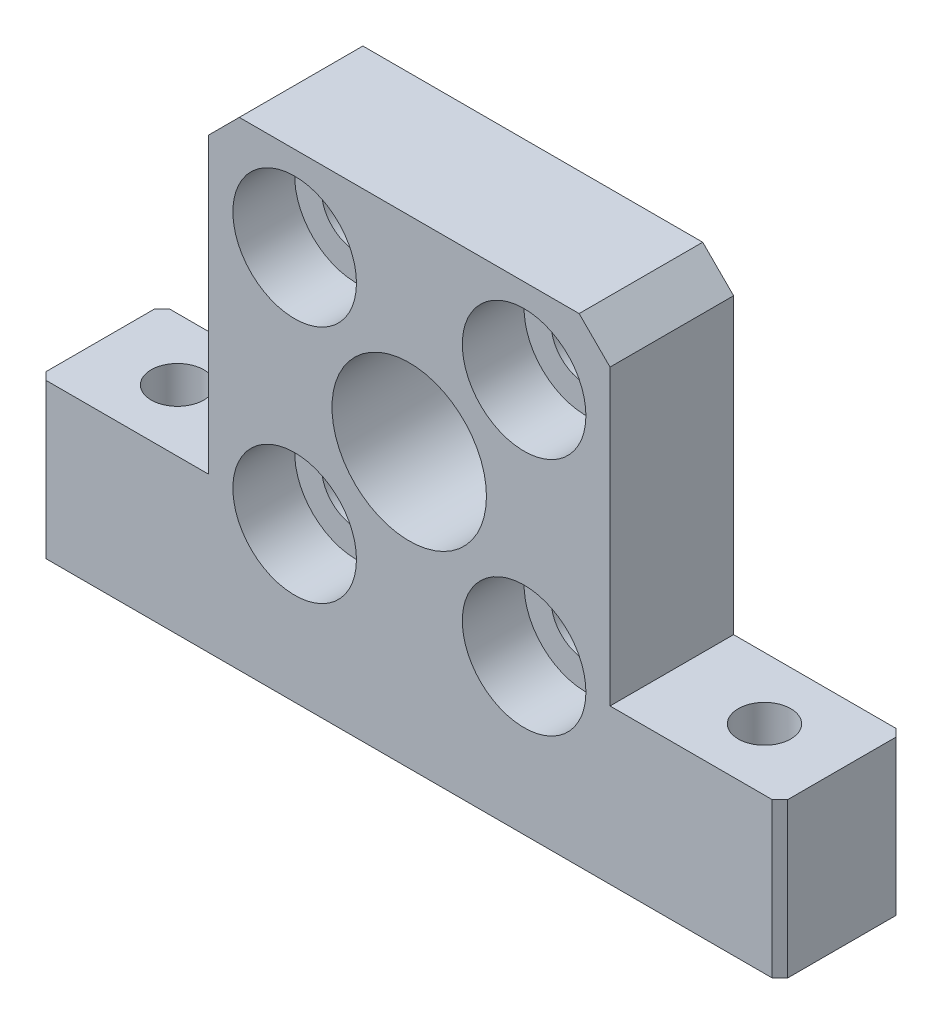
ISO-10303-21;
HEADER;
FILE_DESCRIPTION(('STEP AP214'),'2;1');
FILE_NAME('part.step','',(''),(''),'','','');
FILE_SCHEMA(('AUTOMOTIVE_DESIGN { 1 0 10303 214 1 1 1 1 }'));
ENDSEC;
DATA;
#1=APPLICATION_CONTEXT('core data for automotive mechanical design processes');
#2=APPLICATION_PROTOCOL_DEFINITION('international standard','automotive_design',2000,#1);
#3=PRODUCT_CONTEXT('',#1,'mechanical');
#4=PRODUCT('Part','Part','',(#3));
#5=PRODUCT_RELATED_PRODUCT_CATEGORY('part','',(#4));
#6=PRODUCT_DEFINITION_FORMATION('','',#4);
#7=PRODUCT_DEFINITION_CONTEXT('part definition',#1,'design');
#8=PRODUCT_DEFINITION('design','',#6,#7);
#9=PRODUCT_DEFINITION_SHAPE('','',#8);
#10=(LENGTH_UNIT() NAMED_UNIT(*) SI_UNIT(.MILLI.,.METRE.));
#11=(NAMED_UNIT(*) PLANE_ANGLE_UNIT() SI_UNIT($,.RADIAN.));
#12=(NAMED_UNIT(*) SI_UNIT($,.STERADIAN.) SOLID_ANGLE_UNIT());
#13=UNCERTAINTY_MEASURE_WITH_UNIT(LENGTH_MEASURE(1.E-05),#10,'distance_accuracy_value','');
#14=(GEOMETRIC_REPRESENTATION_CONTEXT(3) GLOBAL_UNCERTAINTY_ASSIGNED_CONTEXT((#13)) GLOBAL_UNIT_ASSIGNED_CONTEXT((#10,
#11,#12)) REPRESENTATION_CONTEXT('',''));
#15=CARTESIAN_POINT('',(0.,0.,0.));
#16=DIRECTION('',(0.,0.,1.));
#17=DIRECTION('',(1.,0.,0.));
#18=AXIS2_PLACEMENT_3D('',#15,#16,#17);
#19=CARTESIAN_POINT('',(-3.43711475409836,-11.0194754098361,8.));
#20=DIRECTION('',(0.,0.,-1.));
#21=DIRECTION('',(-1.,0.,0.));
#22=AXIS2_PLACEMENT_3D('',#19,#20,#21);
#23=CYLINDRICAL_SURFACE('',#22,2.25);
#24=CARTESIAN_POINT('',(-3.43711475409836,-11.0194754098361,0.));
#25=DIRECTION('',(0.,0.,1.));
#26=DIRECTION('',(1.,0.,0.));
#27=AXIS2_PLACEMENT_3D('',#24,#25,#26);
#28=CIRCLE('',#27,2.25);
#29=CARTESIAN_POINT('',(-1.18711475409836,-11.0194754098361,0.));
#30=VERTEX_POINT('',#29);
#31=EDGE_CURVE('E265',#30,#30,#28,.T.);
#32=ORIENTED_EDGE('',*,*,#31,.F.);
#33=EDGE_LOOP('',(#32));
#34=FACE_BOUND('',#33,.T.);
#35=CARTESIAN_POINT('',(-3.43711475409836,-11.0194754098361,4.));
#36=DIRECTION('',(0.,0.,1.));
#37=DIRECTION('',(1.,0.,0.));
#38=AXIS2_PLACEMENT_3D('',#35,#36,#37);
#39=CIRCLE('',#38,2.25);
#40=CARTESIAN_POINT('',(-1.18711475409836,-11.0194754098361,4.));
#41=VERTEX_POINT('',#40);
#42=EDGE_CURVE('E181',#41,#41,#39,.T.);
#43=ORIENTED_EDGE('',*,*,#42,.T.);
#44=EDGE_LOOP('',(#43));
#45=FACE_BOUND('',#44,.T.);
#46=ADVANCED_FACE('F32',(#34,#45),#23,.F.);
#47=CARTESIAN_POINT('',(11.416131147541,-11.0194754098361,8.));
#48=DIRECTION('',(0.,0.,-1.));
#49=DIRECTION('',(-1.,0.,0.));
#50=AXIS2_PLACEMENT_3D('',#47,#48,#49);
#51=CYLINDRICAL_SURFACE('',#50,2.25);
#52=CARTESIAN_POINT('',(11.416131147541,-11.0194754098361,0.));
#53=DIRECTION('',(0.,0.,1.));
#54=DIRECTION('',(1.,0.,0.));
#55=AXIS2_PLACEMENT_3D('',#52,#53,#54);
#56=CIRCLE('',#55,2.25);
#57=CARTESIAN_POINT('',(13.666131147541,-11.0194754098361,0.));
#58=VERTEX_POINT('',#57);
#59=EDGE_CURVE('E275',#58,#58,#56,.T.);
#60=ORIENTED_EDGE('',*,*,#59,.F.);
#61=EDGE_LOOP('',(#60));
#62=FACE_BOUND('',#61,.T.);
#63=CARTESIAN_POINT('',(11.416131147541,-11.0194754098361,4.));
#64=DIRECTION('',(0.,0.,1.));
#65=DIRECTION('',(1.,0.,0.));
#66=AXIS2_PLACEMENT_3D('',#63,#64,#65);
#67=CIRCLE('',#66,2.25);
#68=CARTESIAN_POINT('',(13.666131147541,-11.0194754098361,4.));
#69=VERTEX_POINT('',#68);
#70=EDGE_CURVE('E177',#69,#69,#67,.T.);
#71=ORIENTED_EDGE('',*,*,#70,.T.);
#72=EDGE_LOOP('',(#71));
#73=FACE_BOUND('',#72,.T.);
#74=ADVANCED_FACE('F376',(#62,#73),#51,.F.);
#75=CARTESIAN_POINT('',(11.416131147541,4.48052459016393,8.));
#76=DIRECTION('',(0.,0.,-1.));
#77=DIRECTION('',(-1.,0.,0.));
#78=AXIS2_PLACEMENT_3D('',#75,#76,#77);
#79=CYLINDRICAL_SURFACE('',#78,2.25);
#80=CARTESIAN_POINT('',(11.416131147541,4.48052459016393,0.));
#81=DIRECTION('',(0.,0.,1.));
#82=DIRECTION('',(1.,0.,0.));
#83=AXIS2_PLACEMENT_3D('',#80,#81,#82);
#84=CIRCLE('',#83,2.25);
#85=CARTESIAN_POINT('',(13.666131147541,4.48052459016393,0.));
#86=VERTEX_POINT('',#85);
#87=EDGE_CURVE('E281',#86,#86,#84,.T.);
#88=ORIENTED_EDGE('',*,*,#87,.F.);
#89=EDGE_LOOP('',(#88));
#90=FACE_BOUND('',#89,.T.);
#91=CARTESIAN_POINT('',(11.416131147541,4.48052459016393,4.));
#92=DIRECTION('',(0.,0.,1.));
#93=DIRECTION('',(1.,0.,0.));
#94=AXIS2_PLACEMENT_3D('',#91,#92,#93);
#95=CIRCLE('',#94,2.25);
#96=CARTESIAN_POINT('',(13.666131147541,4.48052459016393,4.));
#97=VERTEX_POINT('',#96);
#98=EDGE_CURVE('E174',#97,#97,#95,.T.);
#99=ORIENTED_EDGE('',*,*,#98,.T.);
#100=EDGE_LOOP('',(#99));
#101=FACE_BOUND('',#100,.T.);
#102=ADVANCED_FACE('F382',(#90,#101),#79,.F.);
#103=CARTESIAN_POINT('',(-3.43711475409836,4.48052459016393,8.));
#104=DIRECTION('',(0.,0.,-1.));
#105=DIRECTION('',(-1.,0.,0.));
#106=AXIS2_PLACEMENT_3D('',#103,#104,#105);
#107=CYLINDRICAL_SURFACE('',#106,2.25);
#108=CARTESIAN_POINT('',(-3.43711475409836,4.48052459016393,0.));
#109=DIRECTION('',(0.,0.,1.));
#110=DIRECTION('',(1.,0.,0.));
#111=AXIS2_PLACEMENT_3D('',#108,#109,#110);
#112=CIRCLE('',#111,2.25);
#113=CARTESIAN_POINT('',(-1.18711475409836,4.48052459016393,0.));
#114=VERTEX_POINT('',#113);
#115=EDGE_CURVE('E278',#114,#114,#112,.T.);
#116=ORIENTED_EDGE('',*,*,#115,.F.);
#117=EDGE_LOOP('',(#116));
#118=FACE_BOUND('',#117,.T.);
#119=CARTESIAN_POINT('',(-3.43711475409836,4.48052459016393,4.));
#120=DIRECTION('',(0.,0.,1.));
#121=DIRECTION('',(1.,0.,0.));
#122=AXIS2_PLACEMENT_3D('',#119,#120,#121);
#123=CIRCLE('',#122,2.25);
#124=CARTESIAN_POINT('',(-1.18711475409836,4.48052459016393,4.));
#125=VERTEX_POINT('',#124);
#126=EDGE_CURVE('E169',#125,#125,#123,.T.);
#127=ORIENTED_EDGE('',*,*,#126,.T.);
#128=EDGE_LOOP('',(#127));
#129=FACE_BOUND('',#128,.T.);
#130=ADVANCED_FACE('F391',(#118,#129),#107,.F.);
#131=CARTESIAN_POINT('',(0.,0.,8.));
#132=DIRECTION('',(0.,0.,1.));
#133=DIRECTION('',(1.,0.,0.));
#134=AXIS2_PLACEMENT_3D('',#131,#132,#133);
#135=PLANE('',#134);
#136=CARTESIAN_POINT('',(11.416131147541,4.48052459016393,8.));
#137=DIRECTION('',(0.,0.,1.));
#138=DIRECTION('',(1.,0.,0.));
#139=AXIS2_PLACEMENT_3D('',#136,#137,#138);
#140=CIRCLE('',#139,4.);
#141=CARTESIAN_POINT('',(15.416131147541,4.48052459016393,8.));
#142=VERTEX_POINT('',#141);
#143=EDGE_CURVE('E306',#142,#142,#140,.T.);
#144=ORIENTED_EDGE('',*,*,#143,.F.);
#145=EDGE_LOOP('',(#144));
#146=FACE_BOUND('',#145,.T.);
#147=CARTESIAN_POINT('',(-3.43711475409836,-11.0194754098361,8.));
#148=DIRECTION('',(0.,0.,1.));
#149=DIRECTION('',(1.,0.,0.));
#150=AXIS2_PLACEMENT_3D('',#147,#148,#149);
#151=CIRCLE('',#150,4.);
#152=CARTESIAN_POINT('',(0.562885245901642,-11.0194754098361,8.));
#153=VERTEX_POINT('',#152);
#154=EDGE_CURVE('E300',#153,#153,#151,.T.);
#155=ORIENTED_EDGE('',*,*,#154,.F.);
#156=EDGE_LOOP('',(#155));
#157=FACE_BOUND('',#156,.T.);
#158=CARTESIAN_POINT('',(11.416131147541,-11.0194754098361,8.));
#159=DIRECTION('',(0.,0.,1.));
#160=DIRECTION('',(1.,0.,0.));
#161=AXIS2_PLACEMENT_3D('',#158,#159,#160);
#162=CIRCLE('',#161,4.);
#163=CARTESIAN_POINT('',(15.416131147541,-11.0194754098361,8.));
#164=VERTEX_POINT('',#163);
#165=EDGE_CURVE('E293',#164,#164,#162,.T.);
#166=ORIENTED_EDGE('',*,*,#165,.F.);
#167=EDGE_LOOP('',(#166));
#168=FACE_BOUND('',#167,.T.);
#169=CARTESIAN_POINT('',(-3.43711475409836,4.48052459016393,8.));
#170=DIRECTION('',(0.,0.,1.));
#171=DIRECTION('',(1.,0.,0.));
#172=AXIS2_PLACEMENT_3D('',#169,#170,#171);
#173=CIRCLE('',#172,4.);
#174=CARTESIAN_POINT('',(0.562885245901642,4.48052459016393,8.));
#175=VERTEX_POINT('',#174);
#176=EDGE_CURVE('E184',#175,#175,#173,.T.);
#177=ORIENTED_EDGE('',*,*,#176,.F.);
#178=EDGE_LOOP('',(#177));
#179=FACE_BOUND('',#178,.T.);
#180=DIRECTION('',(1.,0.,0.));
#181=VECTOR('',#180,1.);
#182=CARTESIAN_POINT('',(-20.0218579234973,-21.0194754098361,8.));
#183=LINE('',#182,#181);
#184=CARTESIAN_POINT('',(-19.5218579234973,-21.0194754098361,8.));
#185=VERTEX_POINT('',#184);
#186=CARTESIAN_POINT('',(27.4781420765028,-21.0194754098361,8.));
#187=VERTEX_POINT('',#186);
#188=EDGE_CURVE('E154',#185,#187,#183,.T.);
#189=ORIENTED_EDGE('',*,*,#188,.T.);
#190=DIRECTION('',(0.,1.,0.));
#191=VECTOR('',#190,1.);
#192=CARTESIAN_POINT('',(27.4781420765027,-11.0194754098361,8.));
#193=LINE('',#192,#191);
#194=CARTESIAN_POINT('',(27.4781420765027,-11.0194754098361,8.));
#195=VERTEX_POINT('',#194);
#196=EDGE_CURVE('E205',#187,#195,#193,.T.);
#197=ORIENTED_EDGE('',*,*,#196,.T.);
#198=DIRECTION('',(-1.,0.,0.));
#199=VECTOR('',#198,1.);
#200=CARTESIAN_POINT('',(16.9781420765027,-11.0194754098361,8.));
#201=LINE('',#200,#199);
#202=CARTESIAN_POINT('',(16.9781420765027,-11.0194754098361,8.));
#203=VERTEX_POINT('',#202);
#204=EDGE_CURVE('E270',#195,#203,#201,.T.);
#205=ORIENTED_EDGE('',*,*,#204,.T.);
#206=DIRECTION('',(0.,1.,0.));
#207=VECTOR('',#206,1.);
#208=CARTESIAN_POINT('',(16.9781420765027,9.98052459016393,8.));
#209=LINE('',#208,#207);
#210=CARTESIAN_POINT('',(16.9781420765027,7.98052459016392,8.));
#211=VERTEX_POINT('',#210);
#212=EDGE_CURVE('E267',#203,#211,#209,.T.);
#213=ORIENTED_EDGE('',*,*,#212,.T.);
#214=DIRECTION('',(0.707106781186546,-0.707106781186549,0.));
#215=VECTOR('',#214,1.);
#216=CARTESIAN_POINT('',(12.4793333333334,12.4793333333333,8.));
#217=LINE('',#216,#215);
#218=CARTESIAN_POINT('',(14.9781420765027,9.98052459016393,8.));
#219=VERTEX_POINT('',#218);
#220=EDGE_CURVE('E199',#211,#219,#217,.F.);
#221=ORIENTED_EDGE('',*,*,#220,.T.);
#222=DIRECTION('',(-1.,0.,0.));
#223=VECTOR('',#222,1.);
#224=CARTESIAN_POINT('',(-9.02185792349727,9.98052459016393,8.));
#225=LINE('',#224,#223);
#226=CARTESIAN_POINT('',(-7.02185792349725,9.98052459016393,8.));
#227=VERTEX_POINT('',#226);
#228=EDGE_CURVE('E252',#219,#227,#225,.T.);
#229=ORIENTED_EDGE('',*,*,#228,.T.);
#230=DIRECTION('',(0.707106781186549,0.707106781186546,0.));
#231=VECTOR('',#230,1.);
#232=CARTESIAN_POINT('',(-8.50119125683058,8.50119125683061,8.));
#233=LINE('',#232,#231);
#234=CARTESIAN_POINT('',(-9.02185792349727,7.98052459016392,8.));
#235=VERTEX_POINT('',#234);
#236=EDGE_CURVE('E143',#227,#235,#233,.F.);
#237=ORIENTED_EDGE('',*,*,#236,.T.);
#238=DIRECTION('',(0.,-1.,0.));
#239=VECTOR('',#238,1.);
#240=CARTESIAN_POINT('',(-9.02185792349727,9.98052459016393,8.));
#241=LINE('',#240,#239);
#242=CARTESIAN_POINT('',(-9.02185792349726,-11.0194754098361,8.));
#243=VERTEX_POINT('',#242);
#244=EDGE_CURVE('E133',#235,#243,#241,.T.);
#245=ORIENTED_EDGE('',*,*,#244,.T.);
#246=DIRECTION('',(-1.,0.,0.));
#247=VECTOR('',#246,1.);
#248=CARTESIAN_POINT('',(-20.0218579234973,-11.0194754098361,8.));
#249=LINE('',#248,#247);
#250=CARTESIAN_POINT('',(-19.5218579234973,-11.0194754098361,8.));
#251=VERTEX_POINT('',#250);
#252=EDGE_CURVE('E139',#243,#251,#249,.T.);
#253=ORIENTED_EDGE('',*,*,#252,.T.);
#254=DIRECTION('',(0.,-1.,0.));
#255=VECTOR('',#254,1.);
#256=CARTESIAN_POINT('',(-19.5218579234973,-21.0194754098361,8.));
#257=LINE('',#256,#255);
#258=EDGE_CURVE('E203',#251,#185,#257,.T.);
#259=ORIENTED_EDGE('',*,*,#258,.T.);
#260=EDGE_LOOP('',(#189,#197,#205,#213,#221,#229,#237,#245,#253,#259));
#261=FACE_BOUND('',#260,.T.);
#262=CARTESIAN_POINT('',(3.97814207650273,-3.26947540983607,8.));
#263=DIRECTION('',(0.,0.,1.));
#264=DIRECTION('',(1.,0.,0.));
#265=AXIS2_PLACEMENT_3D('',#262,#263,#264);
#266=CIRCLE('',#265,5.);
#267=CARTESIAN_POINT('',(8.97814207650273,-3.26947540983607,8.));
#268=VERTEX_POINT('',#267);
#269=EDGE_CURVE('E284',#268,#268,#266,.T.);
#270=ORIENTED_EDGE('',*,*,#269,.F.);
#271=EDGE_LOOP('',(#270));
#272=FACE_BOUND('',#271,.T.);
#273=ADVANCED_FACE('F136',(#146,#157,#168,#179,#261,#272),#135,.T.);
#274=CARTESIAN_POINT('',(0.,0.,0.));
#275=DIRECTION('',(0.,0.,1.));
#276=DIRECTION('',(1.,0.,0.));
#277=AXIS2_PLACEMENT_3D('',#274,#275,#276);
#278=PLANE('',#277);
#279=DIRECTION('',(-1.,0.,0.));
#280=VECTOR('',#279,1.);
#281=CARTESIAN_POINT('',(16.9781420765027,-11.0194754098361,0.));
#282=LINE('',#281,#280);
#283=CARTESIAN_POINT('',(27.4781420765027,-11.0194754098361,0.));
#284=VERTEX_POINT('',#283);
#285=CARTESIAN_POINT('',(16.9781420765027,-11.0194754098361,0.));
#286=VERTEX_POINT('',#285);
#287=EDGE_CURVE('E258',#284,#286,#282,.T.);
#288=ORIENTED_EDGE('',*,*,#287,.F.);
#289=DIRECTION('',(0.,-1.,0.));
#290=VECTOR('',#289,1.);
#291=CARTESIAN_POINT('',(27.4781420765027,0.,0.));
#292=LINE('',#291,#290);
#293=CARTESIAN_POINT('',(27.4781420765027,-21.0194754098361,0.));
#294=VERTEX_POINT('',#293);
#295=EDGE_CURVE('E227',#284,#294,#292,.T.);
#296=ORIENTED_EDGE('',*,*,#295,.T.);
#297=DIRECTION('',(1.,0.,0.));
#298=VECTOR('',#297,1.);
#299=CARTESIAN_POINT('',(-20.0218579234973,-21.0194754098361,0.));
#300=LINE('',#299,#298);
#301=CARTESIAN_POINT('',(-19.5218579234973,-21.0194754098361,0.));
#302=VERTEX_POINT('',#301);
#303=EDGE_CURVE('E260',#302,#294,#300,.T.);
#304=ORIENTED_EDGE('',*,*,#303,.F.);
#305=DIRECTION('',(0.,1.,0.));
#306=VECTOR('',#305,1.);
#307=CARTESIAN_POINT('',(-19.5218579234973,0.,0.));
#308=LINE('',#307,#306);
#309=CARTESIAN_POINT('',(-19.5218579234973,-11.0194754098361,0.));
#310=VERTEX_POINT('',#309);
#311=EDGE_CURVE('E225',#302,#310,#308,.T.);
#312=ORIENTED_EDGE('',*,*,#311,.T.);
#313=DIRECTION('',(-1.,0.,0.));
#314=VECTOR('',#313,1.);
#315=CARTESIAN_POINT('',(-20.0218579234973,-11.0194754098361,0.));
#316=LINE('',#315,#314);
#317=CARTESIAN_POINT('',(-9.02185792349726,-11.0194754098361,0.));
#318=VERTEX_POINT('',#317);
#319=EDGE_CURVE('E262',#318,#310,#316,.T.);
#320=ORIENTED_EDGE('',*,*,#319,.F.);
#321=DIRECTION('',(0.,-1.,0.));
#322=VECTOR('',#321,1.);
#323=CARTESIAN_POINT('',(-9.02185792349727,9.98052459016393,0.));
#324=LINE('',#323,#322);
#325=CARTESIAN_POINT('',(-9.02185792349727,7.98052459016392,0.));
#326=VERTEX_POINT('',#325);
#327=EDGE_CURVE('E158',#326,#318,#324,.T.);
#328=ORIENTED_EDGE('',*,*,#327,.F.);
#329=DIRECTION('',(-0.707106781186549,-0.707106781186546,0.));
#330=VECTOR('',#329,1.);
#331=CARTESIAN_POINT('',(-9.02185792349727,7.98052459016392,0.));
#332=LINE('',#331,#330);
#333=CARTESIAN_POINT('',(-7.02185792349725,9.98052459016393,0.));
#334=VERTEX_POINT('',#333);
#335=EDGE_CURVE('E192',#326,#334,#332,.F.);
#336=ORIENTED_EDGE('',*,*,#335,.T.);
#337=DIRECTION('',(-1.,0.,0.));
#338=VECTOR('',#337,1.);
#339=CARTESIAN_POINT('',(-9.02185792349727,9.98052459016393,0.));
#340=LINE('',#339,#338);
#341=CARTESIAN_POINT('',(14.9781420765027,9.98052459016393,0.));
#342=VERTEX_POINT('',#341);
#343=EDGE_CURVE('E148',#342,#334,#340,.T.);
#344=ORIENTED_EDGE('',*,*,#343,.F.);
#345=DIRECTION('',(-0.707106781186546,0.707106781186549,0.));
#346=VECTOR('',#345,1.);
#347=CARTESIAN_POINT('',(14.9781420765027,9.98052459016393,0.));
#348=LINE('',#347,#346);
#349=CARTESIAN_POINT('',(16.9781420765027,7.98052459016392,0.));
#350=VERTEX_POINT('',#349);
#351=EDGE_CURVE('E194',#342,#350,#348,.F.);
#352=ORIENTED_EDGE('',*,*,#351,.T.);
#353=DIRECTION('',(0.,1.,0.));
#354=VECTOR('',#353,1.);
#355=CARTESIAN_POINT('',(16.9781420765027,9.98052459016393,0.));
#356=LINE('',#355,#354);
#357=EDGE_CURVE('E255',#286,#350,#356,.T.);
#358=ORIENTED_EDGE('',*,*,#357,.F.);
#359=EDGE_LOOP('',(#288,#296,#304,#312,#320,#328,#336,#344,#352,#358));
#360=FACE_BOUND('',#359,.T.);
#361=ORIENTED_EDGE('',*,*,#31,.T.);
#362=EDGE_LOOP('',(#361));
#363=FACE_BOUND('',#362,.T.);
#364=ORIENTED_EDGE('',*,*,#59,.T.);
#365=EDGE_LOOP('',(#364));
#366=FACE_BOUND('',#365,.T.);
#367=ORIENTED_EDGE('',*,*,#115,.T.);
#368=EDGE_LOOP('',(#367));
#369=FACE_BOUND('',#368,.T.);
#370=ORIENTED_EDGE('',*,*,#87,.T.);
#371=EDGE_LOOP('',(#370));
#372=FACE_BOUND('',#371,.T.);
#373=CARTESIAN_POINT('',(3.97814207650273,-3.26947540983607,0.));
#374=DIRECTION('',(0.,0.,1.));
#375=DIRECTION('',(1.,0.,0.));
#376=AXIS2_PLACEMENT_3D('',#373,#374,#375);
#377=CIRCLE('',#376,5.);
#378=CARTESIAN_POINT('',(8.97814207650273,-3.26947540983607,0.));
#379=VERTEX_POINT('',#378);
#380=EDGE_CURVE('E172',#379,#379,#377,.T.);
#381=ORIENTED_EDGE('',*,*,#380,.T.);
#382=EDGE_LOOP('',(#381));
#383=FACE_BOUND('',#382,.T.);
#384=ADVANCED_FACE('F353',(#360,#363,#366,#369,#372,#383),#278,.F.);
#385=CARTESIAN_POINT('',(-9.02185792349727,9.98052459016393,8.));
#386=DIRECTION('',(1.,0.,0.));
#387=DIRECTION('',(0.,1.,0.));
#388=AXIS2_PLACEMENT_3D('',#385,#386,#387);
#389=PLANE('',#388);
#390=ORIENTED_EDGE('',*,*,#244,.F.);
#391=DIRECTION('',(0.,0.,-1.));
#392=VECTOR('',#391,1.);
#393=CARTESIAN_POINT('',(-9.02185792349727,7.98052459016392,8.));
#394=LINE('',#393,#392);
#395=EDGE_CURVE('E201',#235,#326,#394,.T.);
#396=ORIENTED_EDGE('',*,*,#395,.T.);
#397=ORIENTED_EDGE('',*,*,#327,.T.);
#398=DIRECTION('',(0.,0.,-1.));
#399=VECTOR('',#398,1.);
#400=CARTESIAN_POINT('',(-9.02185792349726,-11.0194754098361,8.));
#401=LINE('',#400,#399);
#402=EDGE_CURVE('E152',#243,#318,#401,.T.);
#403=ORIENTED_EDGE('',*,*,#402,.F.);
#404=EDGE_LOOP('',(#390,#396,#397,#403));
#405=FACE_BOUND('',#404,.T.);
#406=ADVANCED_FACE('F156',(#405),#389,.F.);
#407=CARTESIAN_POINT('',(-20.0218579234973,-11.0194754098361,8.));
#408=DIRECTION('',(0.,-1.,0.));
#409=DIRECTION('',(0.,0.,-1.));
#410=AXIS2_PLACEMENT_3D('',#407,#408,#409);
#411=PLANE('',#410);
#412=CARTESIAN_POINT('',(-15.0218579234973,-11.0194754098361,4.));
#413=DIRECTION('',(0.,-1.,0.));
#414=DIRECTION('',(0.,0.,-1.));
#415=AXIS2_PLACEMENT_3D('',#412,#413,#414);
#416=CIRCLE('',#415,1.70157274707284);
#417=CARTESIAN_POINT('',(-15.0218579234973,-11.0194754098361,2.29842725292716));
#418=VERTEX_POINT('',#417);
#419=EDGE_CURVE('E297',#418,#418,#416,.T.);
#420=ORIENTED_EDGE('',*,*,#419,.T.);
#421=EDGE_LOOP('',(#420));
#422=FACE_BOUND('',#421,.T.);
#423=ORIENTED_EDGE('',*,*,#319,.T.);
#424=DIRECTION('',(0.707106781186552,0.,-0.707106781186543));
#425=VECTOR('',#424,1.);
#426=CARTESIAN_POINT('',(-20.0218579234973,-11.0194754098361,0.499999999999994));
#427=LINE('',#426,#425);
#428=CARTESIAN_POINT('',(-20.0218579234973,-11.0194754098361,0.499999999999994));
#429=VERTEX_POINT('',#428);
#430=EDGE_CURVE('E11',#310,#429,#427,.F.);
#431=ORIENTED_EDGE('',*,*,#430,.T.);
#432=DIRECTION('',(0.,0.,-1.));
#433=VECTOR('',#432,1.);
#434=CARTESIAN_POINT('',(-20.0218579234973,-11.0194754098361,8.));
#435=LINE('',#434,#433);
#436=CARTESIAN_POINT('',(-20.0218579234973,-11.0194754098361,7.5));
#437=VERTEX_POINT('',#436);
#438=EDGE_CURVE('E161',#437,#429,#435,.T.);
#439=ORIENTED_EDGE('',*,*,#438,.F.);
#440=DIRECTION('',(0.707106781186543,0.,0.707106781186552));
#441=VECTOR('',#440,1.);
#442=CARTESIAN_POINT('',(-19.5218579234973,-11.0194754098361,8.));
#443=LINE('',#442,#441);
#444=EDGE_CURVE('E40',#437,#251,#443,.T.);
#445=ORIENTED_EDGE('',*,*,#444,.T.);
#446=ORIENTED_EDGE('',*,*,#252,.F.);
#447=ORIENTED_EDGE('',*,*,#402,.T.);
#448=EDGE_LOOP('',(#423,#431,#439,#445,#446,#447));
#449=FACE_BOUND('',#448,.T.);
#450=ADVANCED_FACE('F151',(#422,#449),#411,.F.);
#451=CARTESIAN_POINT('',(-20.0218579234973,-21.0194754098361,8.));
#452=DIRECTION('',(1.,0.,0.));
#453=DIRECTION('',(0.,0.,-1.));
#454=AXIS2_PLACEMENT_3D('',#451,#452,#453);
#455=PLANE('',#454);
#456=ORIENTED_EDGE('',*,*,#438,.T.);
#457=DIRECTION('',(0.,-1.,0.));
#458=VECTOR('',#457,1.);
#459=CARTESIAN_POINT('',(-20.0218579234973,-21.0194754098361,0.499999999999994));
#460=LINE('',#459,#458);
#461=CARTESIAN_POINT('',(-20.0218579234973,-21.0194754098361,0.499999999999994));
#462=VERTEX_POINT('',#461);
#463=EDGE_CURVE('E230',#429,#462,#460,.T.);
#464=ORIENTED_EDGE('',*,*,#463,.T.);
#465=DIRECTION('',(0.,0.,-1.));
#466=VECTOR('',#465,1.);
#467=CARTESIAN_POINT('',(-20.0218579234973,-21.0194754098361,8.));
#468=LINE('',#467,#466);
#469=CARTESIAN_POINT('',(-20.0218579234973,-21.0194754098361,7.5));
#470=VERTEX_POINT('',#469);
#471=EDGE_CURVE('E165',#470,#462,#468,.T.);
#472=ORIENTED_EDGE('',*,*,#471,.F.);
#473=DIRECTION('',(0.,1.,0.));
#474=VECTOR('',#473,1.);
#475=CARTESIAN_POINT('',(-20.0218579234973,-11.0194754098361,7.5));
#476=LINE('',#475,#474);
#477=EDGE_CURVE('E52',#470,#437,#476,.T.);
#478=ORIENTED_EDGE('',*,*,#477,.T.);
#479=EDGE_LOOP('',(#456,#464,#472,#478));
#480=FACE_BOUND('',#479,.T.);
#481=ADVANCED_FACE('F234',(#480),#455,.F.);
#482=CARTESIAN_POINT('',(-20.0218579234973,-21.0194754098361,8.));
#483=DIRECTION('',(0.,1.,0.));
#484=DIRECTION('',(0.,0.,1.));
#485=AXIS2_PLACEMENT_3D('',#482,#483,#484);
#486=PLANE('',#485);
#487=CARTESIAN_POINT('',(22.9781420765027,-21.0194754098361,4.));
#488=DIRECTION('',(0.,1.,0.));
#489=DIRECTION('',(0.,0.,1.));
#490=AXIS2_PLACEMENT_3D('',#487,#488,#489);
#491=CIRCLE('',#490,1.70157274707284);
#492=CARTESIAN_POINT('',(22.9781420765027,-21.0194754098361,5.70157274707284));
#493=VERTEX_POINT('',#492);
#494=EDGE_CURVE('E188',#493,#493,#491,.T.);
#495=ORIENTED_EDGE('',*,*,#494,.T.);
#496=EDGE_LOOP('',(#495));
#497=FACE_BOUND('',#496,.T.);
#498=CARTESIAN_POINT('',(-15.0218579234973,-21.0194754098361,4.));
#499=DIRECTION('',(0.,1.,0.));
#500=DIRECTION('',(0.,0.,1.));
#501=AXIS2_PLACEMENT_3D('',#498,#499,#500);
#502=CIRCLE('',#501,1.70157274707284);
#503=CARTESIAN_POINT('',(-15.0218579234973,-21.0194754098361,5.70157274707284));
#504=VERTEX_POINT('',#503);
#505=EDGE_CURVE('E187',#504,#504,#502,.T.);
#506=ORIENTED_EDGE('',*,*,#505,.T.);
#507=EDGE_LOOP('',(#506));
#508=FACE_BOUND('',#507,.T.);
#509=DIRECTION('',(0.,0.,-1.));
#510=VECTOR('',#509,1.);
#511=CARTESIAN_POINT('',(27.9781420765027,-21.0194754098361,8.));
#512=LINE('',#511,#510);
#513=CARTESIAN_POINT('',(27.9781420765027,-21.0194754098361,7.50000000000001));
#514=VERTEX_POINT('',#513);
#515=CARTESIAN_POINT('',(27.9781420765027,-21.0194754098361,0.499999999999994));
#516=VERTEX_POINT('',#515);
#517=EDGE_CURVE('E242',#514,#516,#512,.T.);
#518=ORIENTED_EDGE('',*,*,#517,.F.);
#519=DIRECTION('',(-0.707106781186543,0.,0.707106781186552));
#520=VECTOR('',#519,1.);
#521=CARTESIAN_POINT('',(27.4781420765027,-21.0194754098361,8.));
#522=LINE('',#521,#520);
#523=EDGE_CURVE('E223',#514,#187,#522,.T.);
#524=ORIENTED_EDGE('',*,*,#523,.T.);
#525=ORIENTED_EDGE('',*,*,#188,.F.);
#526=DIRECTION('',(-0.707106781186543,0.,-0.707106781186552));
#527=VECTOR('',#526,1.);
#528=CARTESIAN_POINT('',(-19.5218579234973,-21.0194754098361,8.));
#529=LINE('',#528,#527);
#530=EDGE_CURVE('E217',#185,#470,#529,.T.);
#531=ORIENTED_EDGE('',*,*,#530,.T.);
#532=ORIENTED_EDGE('',*,*,#471,.T.);
#533=DIRECTION('',(-0.707106781186552,0.,0.707106781186543));
#534=VECTOR('',#533,1.);
#535=CARTESIAN_POINT('',(-20.0218579234973,-21.0194754098361,0.499999999999994));
#536=LINE('',#535,#534);
#537=EDGE_CURVE('E219',#462,#302,#536,.F.);
#538=ORIENTED_EDGE('',*,*,#537,.T.);
#539=ORIENTED_EDGE('',*,*,#303,.T.);
#540=DIRECTION('',(-0.707106781186552,0.,-0.707106781186543));
#541=VECTOR('',#540,1.);
#542=CARTESIAN_POINT('',(27.9781420765027,-21.0194754098361,0.499999999999994));
#543=LINE('',#542,#541);
#544=EDGE_CURVE('E221',#294,#516,#543,.F.);
#545=ORIENTED_EDGE('',*,*,#544,.T.);
#546=EDGE_LOOP('',(#518,#524,#525,#531,#532,#538,#539,#545));
#547=FACE_BOUND('',#546,.T.);
#548=ADVANCED_FACE('F238',(#497,#508,#547),#486,.F.);
#549=CARTESIAN_POINT('',(27.9781420765027,-21.0194754098361,8.));
#550=DIRECTION('',(-1.,0.,0.));
#551=DIRECTION('',(0.,0.,1.));
#552=AXIS2_PLACEMENT_3D('',#549,#550,#551);
#553=PLANE('',#552);
#554=DIRECTION('',(0.,0.,-1.));
#555=VECTOR('',#554,1.);
#556=CARTESIAN_POINT('',(27.9781420765027,-11.0194754098361,8.));
#557=LINE('',#556,#555);
#558=CARTESIAN_POINT('',(27.9781420765027,-11.0194754098361,7.50000000000001));
#559=VERTEX_POINT('',#558);
#560=CARTESIAN_POINT('',(27.9781420765027,-11.0194754098361,0.499999999999994));
#561=VERTEX_POINT('',#560);
#562=EDGE_CURVE('E244',#559,#561,#557,.T.);
#563=ORIENTED_EDGE('',*,*,#562,.F.);
#564=DIRECTION('',(0.,-1.,0.));
#565=VECTOR('',#564,1.);
#566=CARTESIAN_POINT('',(27.9781420765027,-21.0194754098361,7.50000000000001));
#567=LINE('',#566,#565);
#568=EDGE_CURVE('E215',#559,#514,#567,.T.);
#569=ORIENTED_EDGE('',*,*,#568,.T.);
#570=ORIENTED_EDGE('',*,*,#517,.T.);
#571=DIRECTION('',(0.,1.,0.));
#572=VECTOR('',#571,1.);
#573=CARTESIAN_POINT('',(27.9781420765027,-21.0194754098361,0.499999999999994));
#574=LINE('',#573,#572);
#575=EDGE_CURVE('E212',#516,#561,#574,.T.);
#576=ORIENTED_EDGE('',*,*,#575,.T.);
#577=EDGE_LOOP('',(#563,#569,#570,#576));
#578=FACE_BOUND('',#577,.T.);
#579=ADVANCED_FACE('F332',(#578),#553,.F.);
#580=CARTESIAN_POINT('',(16.9781420765027,-11.0194754098361,8.));
#581=DIRECTION('',(0.,-1.,0.));
#582=DIRECTION('',(0.,0.,-1.));
#583=AXIS2_PLACEMENT_3D('',#580,#581,#582);
#584=PLANE('',#583);
#585=CARTESIAN_POINT('',(22.9781420765027,-11.0194754098361,4.));
#586=DIRECTION('',(0.,-1.,0.));
#587=DIRECTION('',(0.,0.,-1.));
#588=AXIS2_PLACEMENT_3D('',#585,#586,#587);
#589=CIRCLE('',#588,1.70157274707284);
#590=CARTESIAN_POINT('',(22.9781420765027,-11.0194754098361,2.29842725292716));
#591=VERTEX_POINT('',#590);
#592=EDGE_CURVE('E185',#591,#591,#589,.T.);
#593=ORIENTED_EDGE('',*,*,#592,.T.);
#594=EDGE_LOOP('',(#593));
#595=FACE_BOUND('',#594,.T.);
#596=ORIENTED_EDGE('',*,*,#204,.F.);
#597=DIRECTION('',(0.707106781186543,0.,-0.707106781186552));
#598=VECTOR('',#597,1.);
#599=CARTESIAN_POINT('',(27.4781420765027,-11.0194754098361,8.));
#600=LINE('',#599,#598);
#601=EDGE_CURVE('E210',#195,#559,#600,.T.);
#602=ORIENTED_EDGE('',*,*,#601,.T.);
#603=ORIENTED_EDGE('',*,*,#562,.T.);
#604=DIRECTION('',(0.707106781186552,0.,0.707106781186543));
#605=VECTOR('',#604,1.);
#606=CARTESIAN_POINT('',(27.9781420765027,-11.0194754098361,0.499999999999994));
#607=LINE('',#606,#605);
#608=EDGE_CURVE('E208',#561,#284,#607,.F.);
#609=ORIENTED_EDGE('',*,*,#608,.T.);
#610=ORIENTED_EDGE('',*,*,#287,.T.);
#611=DIRECTION('',(0.,0.,-1.));
#612=VECTOR('',#611,1.);
#613=CARTESIAN_POINT('',(16.9781420765027,-11.0194754098361,8.));
#614=LINE('',#613,#612);
#615=EDGE_CURVE('E249',#203,#286,#614,.T.);
#616=ORIENTED_EDGE('',*,*,#615,.F.);
#617=EDGE_LOOP('',(#596,#602,#603,#609,#610,#616));
#618=FACE_BOUND('',#617,.T.);
#619=ADVANCED_FACE('F328',(#595,#618),#584,.F.);
#620=CARTESIAN_POINT('',(16.9781420765027,9.98052459016393,8.));
#621=DIRECTION('',(-1.,0.,0.));
#622=DIRECTION('',(0.,-1.,0.));
#623=AXIS2_PLACEMENT_3D('',#620,#621,#622);
#624=PLANE('',#623);
#625=ORIENTED_EDGE('',*,*,#357,.T.);
#626=DIRECTION('',(0.,0.,1.));
#627=VECTOR('',#626,1.);
#628=CARTESIAN_POINT('',(16.9781420765027,7.98052459016392,8.));
#629=LINE('',#628,#627);
#630=EDGE_CURVE('E196',#350,#211,#629,.T.);
#631=ORIENTED_EDGE('',*,*,#630,.T.);
#632=ORIENTED_EDGE('',*,*,#212,.F.);
#633=ORIENTED_EDGE('',*,*,#615,.T.);
#634=EDGE_LOOP('',(#625,#631,#632,#633));
#635=FACE_BOUND('',#634,.T.);
#636=ADVANCED_FACE('F331',(#635),#624,.F.);
#637=CARTESIAN_POINT('',(-9.02185792349727,9.98052459016393,8.));
#638=DIRECTION('',(0.,-1.,0.));
#639=DIRECTION('',(0.,0.,-1.));
#640=AXIS2_PLACEMENT_3D('',#637,#638,#639);
#641=PLANE('',#640);
#642=ORIENTED_EDGE('',*,*,#228,.F.);
#643=DIRECTION('',(0.,0.,-1.));
#644=VECTOR('',#643,1.);
#645=CARTESIAN_POINT('',(14.9781420765027,9.98052459016393,8.));
#646=LINE('',#645,#644);
#647=EDGE_CURVE('E163',#219,#342,#646,.T.);
#648=ORIENTED_EDGE('',*,*,#647,.T.);
#649=ORIENTED_EDGE('',*,*,#343,.T.);
#650=DIRECTION('',(0.,0.,1.));
#651=VECTOR('',#650,1.);
#652=CARTESIAN_POINT('',(-7.02185792349725,9.98052459016393,8.));
#653=LINE('',#652,#651);
#654=EDGE_CURVE('E160',#334,#227,#653,.T.);
#655=ORIENTED_EDGE('',*,*,#654,.T.);
#656=EDGE_LOOP('',(#642,#648,#649,#655));
#657=FACE_BOUND('',#656,.T.);
#658=ADVANCED_FACE('F362',(#657),#641,.F.);
#659=CARTESIAN_POINT('',(3.97814207650273,-3.26947540983607,8.));
#660=DIRECTION('',(0.,0.,-1.));
#661=DIRECTION('',(-1.,0.,0.));
#662=AXIS2_PLACEMENT_3D('',#659,#660,#661);
#663=CYLINDRICAL_SURFACE('',#662,5.);
#664=ORIENTED_EDGE('',*,*,#269,.T.);
#665=EDGE_LOOP('',(#664));
#666=FACE_BOUND('',#665,.T.);
#667=ORIENTED_EDGE('',*,*,#380,.F.);
#668=EDGE_LOOP('',(#667));
#669=FACE_BOUND('',#668,.T.);
#670=ADVANCED_FACE('F397',(#666,#669),#663,.F.);
#671=CARTESIAN_POINT('',(-3.43711475409836,4.48052459016393,4.));
#672=DIRECTION('',(0.,0.,1.));
#673=DIRECTION('',(1.,0.,0.));
#674=AXIS2_PLACEMENT_3D('',#671,#672,#673);
#675=CYLINDRICAL_SURFACE('',#674,4.);
#676=CARTESIAN_POINT('',(-3.43711475409836,4.48052459016393,4.));
#677=DIRECTION('',(0.,0.,1.));
#678=DIRECTION('',(1.,0.,0.));
#679=AXIS2_PLACEMENT_3D('',#676,#677,#678);
#680=CIRCLE('',#679,4.);
#681=CARTESIAN_POINT('',(0.562885245901642,4.48052459016393,4.));
#682=VERTEX_POINT('',#681);
#683=EDGE_CURVE('E173',#682,#682,#680,.T.);
#684=ORIENTED_EDGE('',*,*,#683,.F.);
#685=EDGE_LOOP('',(#684));
#686=FACE_BOUND('',#685,.T.);
#687=ORIENTED_EDGE('',*,*,#176,.T.);
#688=EDGE_LOOP('',(#687));
#689=FACE_BOUND('',#688,.T.);
#690=ADVANCED_FACE('F527',(#686,#689),#675,.F.);
#691=CARTESIAN_POINT('',(-3.43711475409836,4.48052459016393,4.));
#692=DIRECTION('',(0.,0.,1.));
#693=DIRECTION('',(1.,0.,0.));
#694=AXIS2_PLACEMENT_3D('',#691,#692,#693);
#695=PLANE('',#694);
#696=ORIENTED_EDGE('',*,*,#126,.F.);
#697=EDGE_LOOP('',(#696));
#698=FACE_BOUND('',#697,.T.);
#699=ORIENTED_EDGE('',*,*,#683,.T.);
#700=EDGE_LOOP('',(#699));
#701=FACE_BOUND('',#700,.T.);
#702=ADVANCED_FACE('F518',(#698,#701),#695,.T.);
#703=CARTESIAN_POINT('',(11.416131147541,4.48052459016393,4.));
#704=DIRECTION('',(0.,0.,1.));
#705=DIRECTION('',(1.,0.,0.));
#706=AXIS2_PLACEMENT_3D('',#703,#704,#705);
#707=CYLINDRICAL_SURFACE('',#706,4.);
#708=CARTESIAN_POINT('',(11.416131147541,4.48052459016393,4.));
#709=DIRECTION('',(0.,0.,1.));
#710=DIRECTION('',(1.,0.,0.));
#711=AXIS2_PLACEMENT_3D('',#708,#709,#710);
#712=CIRCLE('',#711,4.);
#713=CARTESIAN_POINT('',(15.416131147541,4.48052459016393,4.));
#714=VERTEX_POINT('',#713);
#715=EDGE_CURVE('E178',#714,#714,#712,.T.);
#716=ORIENTED_EDGE('',*,*,#715,.F.);
#717=EDGE_LOOP('',(#716));
#718=FACE_BOUND('',#717,.T.);
#719=ORIENTED_EDGE('',*,*,#143,.T.);
#720=EDGE_LOOP('',(#719));
#721=FACE_BOUND('',#720,.T.);
#722=ADVANCED_FACE('F509',(#718,#721),#707,.F.);
#723=CARTESIAN_POINT('',(11.416131147541,4.48052459016393,4.));
#724=DIRECTION('',(0.,0.,1.));
#725=DIRECTION('',(1.,0.,0.));
#726=AXIS2_PLACEMENT_3D('',#723,#724,#725);
#727=PLANE('',#726);
#728=ORIENTED_EDGE('',*,*,#98,.F.);
#729=EDGE_LOOP('',(#728));
#730=FACE_BOUND('',#729,.T.);
#731=ORIENTED_EDGE('',*,*,#715,.T.);
#732=EDGE_LOOP('',(#731));
#733=FACE_BOUND('',#732,.T.);
#734=ADVANCED_FACE('F500',(#730,#733),#727,.T.);
#735=CARTESIAN_POINT('',(11.416131147541,-11.0194754098361,4.));
#736=DIRECTION('',(0.,0.,1.));
#737=DIRECTION('',(1.,0.,0.));
#738=AXIS2_PLACEMENT_3D('',#735,#736,#737);
#739=CYLINDRICAL_SURFACE('',#738,4.);
#740=CARTESIAN_POINT('',(11.416131147541,-11.0194754098361,4.));
#741=DIRECTION('',(0.,0.,1.));
#742=DIRECTION('',(1.,0.,0.));
#743=AXIS2_PLACEMENT_3D('',#740,#741,#742);
#744=CIRCLE('',#743,4.);
#745=CARTESIAN_POINT('',(15.416131147541,-11.0194754098361,4.));
#746=VERTEX_POINT('',#745);
#747=EDGE_CURVE('E296',#746,#746,#744,.T.);
#748=ORIENTED_EDGE('',*,*,#747,.F.);
#749=EDGE_LOOP('',(#748));
#750=FACE_BOUND('',#749,.T.);
#751=ORIENTED_EDGE('',*,*,#165,.T.);
#752=EDGE_LOOP('',(#751));
#753=FACE_BOUND('',#752,.T.);
#754=ADVANCED_FACE('F491',(#750,#753),#739,.F.);
#755=CARTESIAN_POINT('',(11.416131147541,-11.0194754098361,4.));
#756=DIRECTION('',(0.,0.,1.));
#757=DIRECTION('',(1.,0.,0.));
#758=AXIS2_PLACEMENT_3D('',#755,#756,#757);
#759=PLANE('',#758);
#760=ORIENTED_EDGE('',*,*,#70,.F.);
#761=EDGE_LOOP('',(#760));
#762=FACE_BOUND('',#761,.T.);
#763=ORIENTED_EDGE('',*,*,#747,.T.);
#764=EDGE_LOOP('',(#763));
#765=FACE_BOUND('',#764,.T.);
#766=ADVANCED_FACE('F482',(#762,#765),#759,.T.);
#767=CARTESIAN_POINT('',(-3.43711475409836,-11.0194754098361,4.));
#768=DIRECTION('',(0.,0.,1.));
#769=DIRECTION('',(1.,0.,0.));
#770=AXIS2_PLACEMENT_3D('',#767,#768,#769);
#771=CYLINDRICAL_SURFACE('',#770,4.);
#772=CARTESIAN_POINT('',(-3.43711475409836,-11.0194754098361,4.));
#773=DIRECTION('',(0.,0.,1.));
#774=DIRECTION('',(1.,0.,0.));
#775=AXIS2_PLACEMENT_3D('',#772,#773,#774);
#776=CIRCLE('',#775,4.);
#777=CARTESIAN_POINT('',(0.562885245901642,-11.0194754098361,4.));
#778=VERTEX_POINT('',#777);
#779=EDGE_CURVE('E303',#778,#778,#776,.T.);
#780=ORIENTED_EDGE('',*,*,#779,.F.);
#781=EDGE_LOOP('',(#780));
#782=FACE_BOUND('',#781,.T.);
#783=ORIENTED_EDGE('',*,*,#154,.T.);
#784=EDGE_LOOP('',(#783));
#785=FACE_BOUND('',#784,.T.);
#786=ADVANCED_FACE('F473',(#782,#785),#771,.F.);
#787=CARTESIAN_POINT('',(-3.43711475409836,-11.0194754098361,4.));
#788=DIRECTION('',(0.,0.,1.));
#789=DIRECTION('',(1.,0.,0.));
#790=AXIS2_PLACEMENT_3D('',#787,#788,#789);
#791=PLANE('',#790);
#792=ORIENTED_EDGE('',*,*,#42,.F.);
#793=EDGE_LOOP('',(#792));
#794=FACE_BOUND('',#793,.T.);
#795=ORIENTED_EDGE('',*,*,#779,.T.);
#796=EDGE_LOOP('',(#795));
#797=FACE_BOUND('',#796,.T.);
#798=ADVANCED_FACE('F464',(#794,#797),#791,.T.);
#799=CARTESIAN_POINT('',(-15.0218579234973,-21.0194754098361,4.));
#800=DIRECTION('',(0.,1.,0.));
#801=DIRECTION('',(0.,0.,1.));
#802=AXIS2_PLACEMENT_3D('',#799,#800,#801);
#803=CYLINDRICAL_SURFACE('',#802,1.70157274707284);
#804=ORIENTED_EDGE('',*,*,#505,.F.);
#805=EDGE_LOOP('',(#804));
#806=FACE_BOUND('',#805,.T.);
#807=ORIENTED_EDGE('',*,*,#419,.F.);
#808=EDGE_LOOP('',(#807));
#809=FACE_BOUND('',#808,.T.);
#810=ADVANCED_FACE('F324',(#806,#809),#803,.F.);
#811=CARTESIAN_POINT('',(22.9781420765027,-21.0194754098361,4.));
#812=DIRECTION('',(0.,1.,0.));
#813=DIRECTION('',(0.,0.,1.));
#814=AXIS2_PLACEMENT_3D('',#811,#812,#813);
#815=CYLINDRICAL_SURFACE('',#814,1.70157274707284);
#816=ORIENTED_EDGE('',*,*,#494,.F.);
#817=EDGE_LOOP('',(#816));
#818=FACE_BOUND('',#817,.T.);
#819=ORIENTED_EDGE('',*,*,#592,.F.);
#820=EDGE_LOOP('',(#819));
#821=FACE_BOUND('',#820,.T.);
#822=ADVANCED_FACE('F320',(#818,#821),#815,.F.);
#823=CARTESIAN_POINT('',(14.9781420765027,9.98052459016393,8.));
#824=DIRECTION('',(-0.707106781186549,-0.707106781186546,0.));
#825=DIRECTION('',(0.,0.,-1.));
#826=AXIS2_PLACEMENT_3D('',#823,#824,#825);
#827=PLANE('',#826);
#828=ORIENTED_EDGE('',*,*,#220,.F.);
#829=ORIENTED_EDGE('',*,*,#630,.F.);
#830=ORIENTED_EDGE('',*,*,#351,.F.);
#831=ORIENTED_EDGE('',*,*,#647,.F.);
#832=EDGE_LOOP('',(#828,#829,#830,#831));
#833=FACE_BOUND('',#832,.T.);
#834=ADVANCED_FACE('F323',(#833),#827,.F.);
#835=CARTESIAN_POINT('',(-9.02185792349727,7.98052459016392,8.));
#836=DIRECTION('',(0.707106781186546,-0.707106781186549,0.));
#837=DIRECTION('',(0.,0.,-1.));
#838=AXIS2_PLACEMENT_3D('',#835,#836,#837);
#839=PLANE('',#838);
#840=ORIENTED_EDGE('',*,*,#236,.F.);
#841=ORIENTED_EDGE('',*,*,#654,.F.);
#842=ORIENTED_EDGE('',*,*,#335,.F.);
#843=ORIENTED_EDGE('',*,*,#395,.F.);
#844=EDGE_LOOP('',(#840,#841,#842,#843));
#845=FACE_BOUND('',#844,.T.);
#846=ADVANCED_FACE('F365',(#845),#839,.F.);
#847=CARTESIAN_POINT('',(27.4781420765027,0.,8.));
#848=DIRECTION('',(0.707106781186552,0.,0.707106781186543));
#849=DIRECTION('',(0.,-1.,0.));
#850=AXIS2_PLACEMENT_3D('',#847,#848,#849);
#851=PLANE('',#850);
#852=ORIENTED_EDGE('',*,*,#523,.F.);
#853=ORIENTED_EDGE('',*,*,#568,.F.);
#854=ORIENTED_EDGE('',*,*,#601,.F.);
#855=ORIENTED_EDGE('',*,*,#196,.F.);
#856=EDGE_LOOP('',(#852,#853,#854,#855));
#857=FACE_BOUND('',#856,.T.);
#858=ADVANCED_FACE('F342',(#857),#851,.T.);
#859=CARTESIAN_POINT('',(27.9781420765027,-21.0194754098361,0.499999999999994));
#860=DIRECTION('',(-0.707106781186543,0.,0.707106781186552));
#861=DIRECTION('',(0.,1.,0.));
#862=AXIS2_PLACEMENT_3D('',#859,#860,#861);
#863=PLANE('',#862);
#864=ORIENTED_EDGE('',*,*,#544,.F.);
#865=ORIENTED_EDGE('',*,*,#295,.F.);
#866=ORIENTED_EDGE('',*,*,#608,.F.);
#867=ORIENTED_EDGE('',*,*,#575,.F.);
#868=EDGE_LOOP('',(#864,#865,#866,#867));
#869=FACE_BOUND('',#868,.T.);
#870=ADVANCED_FACE('F349',(#869),#863,.F.);
#871=CARTESIAN_POINT('',(-20.0218579234973,-21.0194754098361,0.499999999999994));
#872=DIRECTION('',(0.707106781186543,0.,0.707106781186552));
#873=DIRECTION('',(0.,-1.,0.));
#874=AXIS2_PLACEMENT_3D('',#871,#872,#873);
#875=PLANE('',#874);
#876=ORIENTED_EDGE('',*,*,#430,.F.);
#877=ORIENTED_EDGE('',*,*,#311,.F.);
#878=ORIENTED_EDGE('',*,*,#537,.F.);
#879=ORIENTED_EDGE('',*,*,#463,.F.);
#880=EDGE_LOOP('',(#876,#877,#878,#879));
#881=FACE_BOUND('',#880,.T.);
#882=ADVANCED_FACE('F367',(#881),#875,.F.);
#883=CARTESIAN_POINT('',(-19.5218579234973,0.,8.));
#884=DIRECTION('',(-0.707106781186552,0.,0.707106781186543));
#885=DIRECTION('',(0.,1.,0.));
#886=AXIS2_PLACEMENT_3D('',#883,#884,#885);
#887=PLANE('',#886);
#888=ORIENTED_EDGE('',*,*,#444,.F.);
#889=ORIENTED_EDGE('',*,*,#477,.F.);
#890=ORIENTED_EDGE('',*,*,#530,.F.);
#891=ORIENTED_EDGE('',*,*,#258,.F.);
#892=EDGE_LOOP('',(#888,#889,#890,#891));
#893=FACE_BOUND('',#892,.T.);
#894=ADVANCED_FACE('F34',(#893),#887,.T.);
#895=CLOSED_SHELL('',(#46,#74,#102,#130,#273,#384,#406,#450,#481,#548,#579,#619,#636,#658,#670,
#690,#702,#722,#734,#754,#766,#786,#798,#810,#822,#834,#846,#858,#870,#882,#894));
#896=MANIFOLD_SOLID_BREP('B2',#895);
#897=ADVANCED_BREP_SHAPE_REPRESENTATION('',(#18,#896),#14);
#898=SHAPE_DEFINITION_REPRESENTATION(#9,#897);
ENDSEC;
END-ISO-10303-21;
